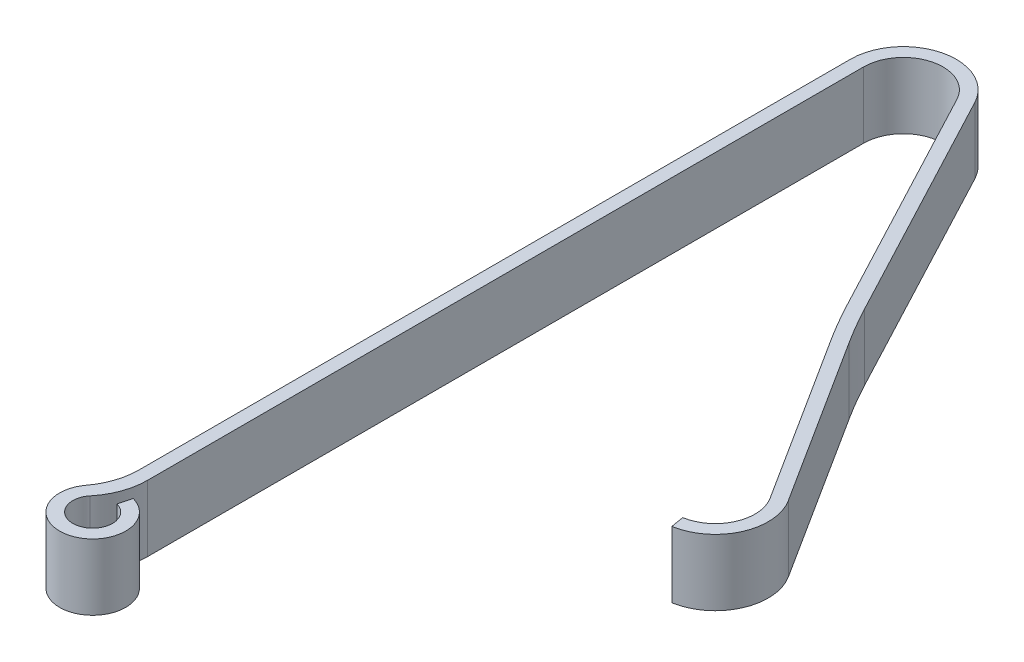
ISO-10303-21;
HEADER;
FILE_DESCRIPTION(('STEP AP214'),'2;1');
FILE_NAME('part.step','',(''),(''),'','','');
FILE_SCHEMA(('AUTOMOTIVE_DESIGN { 1 0 10303 214 1 1 1 1 }'));
ENDSEC;
DATA;
#1=APPLICATION_CONTEXT('core data for automotive mechanical design processes');
#2=APPLICATION_PROTOCOL_DEFINITION('international standard','automotive_design',2000,#1);
#3=PRODUCT_CONTEXT('',#1,'mechanical');
#4=PRODUCT('Part','Part','',(#3));
#5=PRODUCT_RELATED_PRODUCT_CATEGORY('part','',(#4));
#6=PRODUCT_DEFINITION_FORMATION('','',#4);
#7=PRODUCT_DEFINITION_CONTEXT('part definition',#1,'design');
#8=PRODUCT_DEFINITION('design','',#6,#7);
#9=PRODUCT_DEFINITION_SHAPE('','',#8);
#10=(LENGTH_UNIT() NAMED_UNIT(*) SI_UNIT(.MILLI.,.METRE.));
#11=(NAMED_UNIT(*) PLANE_ANGLE_UNIT() SI_UNIT($,.RADIAN.));
#12=(NAMED_UNIT(*) SI_UNIT($,.STERADIAN.) SOLID_ANGLE_UNIT());
#13=UNCERTAINTY_MEASURE_WITH_UNIT(LENGTH_MEASURE(1.E-05),#10,'distance_accuracy_value','');
#14=(GEOMETRIC_REPRESENTATION_CONTEXT(3) GLOBAL_UNCERTAINTY_ASSIGNED_CONTEXT((#13)) GLOBAL_UNIT_ASSIGNED_CONTEXT((#10,
#11,#12)) REPRESENTATION_CONTEXT('',''));
#15=CARTESIAN_POINT('',(0.,0.,0.));
#16=DIRECTION('',(0.,0.,1.));
#17=DIRECTION('',(1.,0.,0.));
#18=AXIS2_PLACEMENT_3D('',#15,#16,#17);
#19=CARTESIAN_POINT('',(1.016,1.27,-14.224));
#20=DIRECTION('',(0.,-1.,0.));
#21=DIRECTION('',(0.,0.,-1.));
#22=AXIS2_PLACEMENT_3D('',#19,#20,#21);
#23=CYLINDRICAL_SURFACE('',#22,1.016);
#24=CARTESIAN_POINT('',(1.016,0.,-14.224));
#25=DIRECTION('',(0.,1.,0.));
#26=DIRECTION('',(0.,0.,-1.));
#27=AXIS2_PLACEMENT_3D('',#24,#25,#26);
#28=CIRCLE('',#27,1.016);
#29=CARTESIAN_POINT('',(1.91419470541014,0.,-14.6988707941885));
#30=VERTEX_POINT('',#29);
#31=CARTESIAN_POINT('',(0.,0.,-14.224));
#32=VERTEX_POINT('',#31);
#33=EDGE_CURVE('E184',#30,#32,#28,.T.);
#34=ORIENTED_EDGE('',*,*,#33,.T.);
#35=DIRECTION('',(0.,-1.,0.));
#36=VECTOR('',#35,1.);
#37=CARTESIAN_POINT('',(0.,1.27,-14.224));
#38=LINE('',#37,#36);
#39=CARTESIAN_POINT('',(0.,1.27,-14.224));
#40=VERTEX_POINT('',#39);
#41=EDGE_CURVE('E166',#40,#32,#38,.T.);
#42=ORIENTED_EDGE('',*,*,#41,.F.);
#43=CARTESIAN_POINT('',(1.016,1.27,-14.224));
#44=DIRECTION('',(0.,1.,0.));
#45=DIRECTION('',(0.,0.,-1.));
#46=AXIS2_PLACEMENT_3D('',#43,#44,#45);
#47=CIRCLE('',#46,1.016);
#48=CARTESIAN_POINT('',(1.91419470541014,1.27,-14.6988707941885));
#49=VERTEX_POINT('',#48);
#50=EDGE_CURVE('E170',#49,#40,#47,.T.);
#51=ORIENTED_EDGE('',*,*,#50,.F.);
#52=DIRECTION('',(0.,-1.,0.));
#53=VECTOR('',#52,1.);
#54=CARTESIAN_POINT('',(1.91419470541014,1.27,-14.6988707941885));
#55=LINE('',#54,#53);
#56=EDGE_CURVE('E269',#49,#30,#55,.T.);
#57=ORIENTED_EDGE('',*,*,#56,.T.);
#58=EDGE_LOOP('',(#34,#42,#51,#57));
#59=FACE_BOUND('',#58,.T.);
#60=ADVANCED_FACE('F39',(#59),#23,.T.);
#61=CARTESIAN_POINT('',(0.,1.27,0.));
#62=DIRECTION('',(1.,0.,0.));
#63=DIRECTION('',(0.,0.,-1.));
#64=AXIS2_PLACEMENT_3D('',#61,#62,#63);
#65=PLANE('',#64);
#66=DIRECTION('',(0.,0.,1.));
#67=VECTOR('',#66,1.);
#68=CARTESIAN_POINT('',(0.,0.,0.));
#69=LINE('',#68,#67);
#70=CARTESIAN_POINT('',(0.,0.,-0.561012886740608));
#71=VERTEX_POINT('',#70);
#72=EDGE_CURVE('E217',#32,#71,#69,.T.);
#73=ORIENTED_EDGE('',*,*,#72,.T.);
#74=DIRECTION('',(0.,1.,0.));
#75=VECTOR('',#74,1.);
#76=CARTESIAN_POINT('',(0.,1.27,-0.561012886740608));
#77=LINE('',#76,#75);
#78=CARTESIAN_POINT('',(0.,1.27,-0.561012886740608));
#79=VERTEX_POINT('',#78);
#80=EDGE_CURVE('E61',#71,#79,#77,.T.);
#81=ORIENTED_EDGE('',*,*,#80,.T.);
#82=DIRECTION('',(0.,0.,1.));
#83=VECTOR('',#82,1.);
#84=CARTESIAN_POINT('',(0.,1.27,0.));
#85=LINE('',#84,#83);
#86=EDGE_CURVE('E162',#40,#79,#85,.T.);
#87=ORIENTED_EDGE('',*,*,#86,.F.);
#88=ORIENTED_EDGE('',*,*,#41,.T.);
#89=EDGE_LOOP('',(#73,#81,#87,#88));
#90=FACE_BOUND('',#89,.T.);
#91=ADVANCED_FACE('F164',(#90),#65,.F.);
#92=CARTESIAN_POINT('',(0.254,1.27,0.581987113259392));
#93=DIRECTION('',(0.,-1.,0.));
#94=DIRECTION('',(0.,0.,-1.));
#95=AXIS2_PLACEMENT_3D('',#92,#93,#94);
#96=CYLINDRICAL_SURFACE('',#95,0.635);
#97=CARTESIAN_POINT('',(0.254,1.27,0.581987113259392));
#98=DIRECTION('',(0.,1.,0.));
#99=DIRECTION('',(0.,0.,1.));
#100=AXIS2_PLACEMENT_3D('',#97,#98,#99);
#101=CIRCLE('',#100,0.635);
#102=CARTESIAN_POINT('',(-0.254,1.27,0.200987113259392));
#103=VERTEX_POINT('',#102);
#104=CARTESIAN_POINT('',(0.418350093640097,1.27,-0.0313757864341675));
#105=VERTEX_POINT('',#104);
#106=EDGE_CURVE('E169',#103,#105,#101,.T.);
#107=ORIENTED_EDGE('',*,*,#106,.F.);
#108=DIRECTION('',(0.,-1.,0.));
#109=VECTOR('',#108,1.);
#110=CARTESIAN_POINT('',(-0.254,1.27,0.200987113259392));
#111=LINE('',#110,#109);
#112=CARTESIAN_POINT('',(-0.254,0.,0.200987113259392));
#113=VERTEX_POINT('',#112);
#114=EDGE_CURVE('E207',#103,#113,#111,.T.);
#115=ORIENTED_EDGE('',*,*,#114,.T.);
#116=CARTESIAN_POINT('',(0.254,0.,0.581987113259392));
#117=DIRECTION('',(0.,1.,0.));
#118=DIRECTION('',(0.,0.,1.));
#119=AXIS2_PLACEMENT_3D('',#116,#117,#118);
#120=CIRCLE('',#119,0.635);
#121=CARTESIAN_POINT('',(0.418350093640097,0.,-0.0313757864341675));
#122=VERTEX_POINT('',#121);
#123=EDGE_CURVE('E219',#113,#122,#120,.T.);
#124=ORIENTED_EDGE('',*,*,#123,.T.);
#125=DIRECTION('',(0.,-1.,0.));
#126=VECTOR('',#125,1.);
#127=CARTESIAN_POINT('',(0.418350093640097,1.27,-0.0313757864341675));
#128=LINE('',#127,#126);
#129=EDGE_CURVE('E187',#105,#122,#128,.T.);
#130=ORIENTED_EDGE('',*,*,#129,.F.);
#131=EDGE_LOOP('',(#107,#115,#124,#130));
#132=FACE_BOUND('',#131,.T.);
#133=ADVANCED_FACE('F225',(#132),#96,.T.);
#134=CARTESIAN_POINT('',(0.418350093640097,1.27,-0.0313757864341675));
#135=DIRECTION('',(0.96592582628907,0.,0.258819045102514));
#136=DIRECTION('',(0.258819045102514,0.,-0.96592582628907));
#137=AXIS2_PLACEMENT_3D('',#134,#135,#136);
#138=PLANE('',#137);
#139=DIRECTION('',(-0.258819045102514,0.,0.96592582628907));
#140=VECTOR('',#139,1.);
#141=CARTESIAN_POINT('',(0.418350093640097,0.,-0.0313757864341675));
#142=LINE('',#141,#140);
#143=CARTESIAN_POINT('',(0.352610056184058,0.,0.213969373443256));
#144=VERTEX_POINT('',#143);
#145=EDGE_CURVE('E274',#122,#144,#142,.T.);
#146=ORIENTED_EDGE('',*,*,#145,.T.);
#147=DIRECTION('',(0.,-1.,0.));
#148=VECTOR('',#147,1.);
#149=CARTESIAN_POINT('',(0.352610056184058,1.27,0.213969373443256));
#150=LINE('',#149,#148);
#151=CARTESIAN_POINT('',(0.352610056184058,1.27,0.213969373443256));
#152=VERTEX_POINT('',#151);
#153=EDGE_CURVE('E195',#152,#144,#150,.T.);
#154=ORIENTED_EDGE('',*,*,#153,.F.);
#155=DIRECTION('',(-0.258819045102514,0.,0.96592582628907));
#156=VECTOR('',#155,1.);
#157=CARTESIAN_POINT('',(0.418350093640097,1.27,-0.0313757864341675));
#158=LINE('',#157,#156);
#159=EDGE_CURVE('E229',#105,#152,#158,.T.);
#160=ORIENTED_EDGE('',*,*,#159,.F.);
#161=ORIENTED_EDGE('',*,*,#129,.T.);
#162=EDGE_LOOP('',(#146,#154,#160,#161));
#163=FACE_BOUND('',#162,.T.);
#164=ADVANCED_FACE('F374',(#163),#138,.F.);
#165=CARTESIAN_POINT('',(0.254,1.27,0.581987113259392));
#166=DIRECTION('',(0.,-1.,0.));
#167=DIRECTION('',(0.,0.,-1.));
#168=AXIS2_PLACEMENT_3D('',#165,#166,#167);
#169=CYLINDRICAL_SURFACE('',#168,0.381);
#170=CARTESIAN_POINT('',(0.254,0.,0.581987113259392));
#171=DIRECTION('',(0.,-1.,0.));
#172=DIRECTION('',(0.,0.,1.));
#173=AXIS2_PLACEMENT_3D('',#170,#171,#172);
#174=CIRCLE('',#173,0.381);
#175=CARTESIAN_POINT('',(-0.0390769230769229,0.,0.338539136969255));
#176=VERTEX_POINT('',#175);
#177=EDGE_CURVE('E277',#144,#176,#174,.T.);
#178=ORIENTED_EDGE('',*,*,#177,.T.);
#179=DIRECTION('',(0.,-1.,0.));
#180=VECTOR('',#179,1.);
#181=CARTESIAN_POINT('',(-0.039076923076923,1.27,0.338539136969255));
#182=LINE('',#181,#180);
#183=CARTESIAN_POINT('',(-0.0390769230769229,1.27,0.338539136969255));
#184=VERTEX_POINT('',#183);
#185=EDGE_CURVE('E201',#176,#184,#182,.F.);
#186=ORIENTED_EDGE('',*,*,#185,.T.);
#187=CARTESIAN_POINT('',(0.254,1.27,0.581987113259392));
#188=DIRECTION('',(0.,-1.,0.));
#189=DIRECTION('',(0.,0.,1.));
#190=AXIS2_PLACEMENT_3D('',#187,#188,#189);
#191=CIRCLE('',#190,0.381);
#192=EDGE_CURVE('E232',#152,#184,#191,.T.);
#193=ORIENTED_EDGE('',*,*,#192,.F.);
#194=ORIENTED_EDGE('',*,*,#153,.T.);
#195=EDGE_LOOP('',(#178,#186,#193,#194));
#196=FACE_BOUND('',#195,.T.);
#197=ADVANCED_FACE('F360',(#196),#169,.F.);
#198=CARTESIAN_POINT('',(0.254,1.27,0.200987113259392));
#199=DIRECTION('',(-1.,0.,0.));
#200=DIRECTION('',(0.,0.,1.));
#201=AXIS2_PLACEMENT_3D('',#198,#199,#200);
#202=PLANE('',#201);
#203=DIRECTION('',(0.,0.,-1.));
#204=VECTOR('',#203,1.);
#205=CARTESIAN_POINT('',(0.254,1.27,0.200987113259392));
#206=LINE('',#205,#204);
#207=CARTESIAN_POINT('',(0.254,1.27,-0.472954117331203));
#208=VERTEX_POINT('',#207);
#209=CARTESIAN_POINT('',(0.254,1.27,-14.224));
#210=VERTEX_POINT('',#209);
#211=EDGE_CURVE('E237',#208,#210,#206,.T.);
#212=ORIENTED_EDGE('',*,*,#211,.F.);
#213=DIRECTION('',(0.,-1.,0.));
#214=VECTOR('',#213,1.);
#215=CARTESIAN_POINT('',(0.254,1.27,-0.472954117331203));
#216=LINE('',#215,#214);
#217=CARTESIAN_POINT('',(0.254,0.,-0.472954117331203));
#218=VERTEX_POINT('',#217);
#219=EDGE_CURVE('E186',#208,#218,#216,.T.);
#220=ORIENTED_EDGE('',*,*,#219,.T.);
#221=DIRECTION('',(0.,0.,-1.));
#222=VECTOR('',#221,1.);
#223=CARTESIAN_POINT('',(0.254,0.,0.200987113259392));
#224=LINE('',#223,#222);
#225=CARTESIAN_POINT('',(0.254,0.,-14.224));
#226=VERTEX_POINT('',#225);
#227=EDGE_CURVE('E281',#218,#226,#224,.T.);
#228=ORIENTED_EDGE('',*,*,#227,.T.);
#229=DIRECTION('',(0.,-1.,0.));
#230=VECTOR('',#229,1.);
#231=CARTESIAN_POINT('',(0.254,1.27,-14.224));
#232=LINE('',#231,#230);
#233=EDGE_CURVE('E351',#210,#226,#232,.T.);
#234=ORIENTED_EDGE('',*,*,#233,.F.);
#235=EDGE_LOOP('',(#212,#220,#228,#234));
#236=FACE_BOUND('',#235,.T.);
#237=ADVANCED_FACE('F370',(#236),#202,.F.);
#238=CARTESIAN_POINT('',(1.016,1.27,-14.224));
#239=DIRECTION('',(0.,-1.,0.));
#240=DIRECTION('',(0.,0.,-1.));
#241=AXIS2_PLACEMENT_3D('',#238,#239,#240);
#242=CYLINDRICAL_SURFACE('',#241,0.762);
#243=CARTESIAN_POINT('',(1.016,0.,-14.224));
#244=DIRECTION('',(0.,-1.,0.));
#245=DIRECTION('',(0.,0.,-1.));
#246=AXIS2_PLACEMENT_3D('',#243,#244,#245);
#247=CIRCLE('',#246,0.762);
#248=CARTESIAN_POINT('',(1.6896460290576,0.,-14.5801530956414));
#249=VERTEX_POINT('',#248);
#250=EDGE_CURVE('E284',#226,#249,#247,.T.);
#251=ORIENTED_EDGE('',*,*,#250,.T.);
#252=DIRECTION('',(0.,-1.,0.));
#253=VECTOR('',#252,1.);
#254=CARTESIAN_POINT('',(1.6896460290576,1.27,-14.5801530956414));
#255=LINE('',#254,#253);
#256=CARTESIAN_POINT('',(1.6896460290576,1.27,-14.5801530956414));
#257=VERTEX_POINT('',#256);
#258=EDGE_CURVE('E347',#257,#249,#255,.T.);
#259=ORIENTED_EDGE('',*,*,#258,.F.);
#260=CARTESIAN_POINT('',(1.016,1.27,-14.224));
#261=DIRECTION('',(0.,-1.,0.));
#262=DIRECTION('',(0.,0.,-1.));
#263=AXIS2_PLACEMENT_3D('',#260,#261,#262);
#264=CIRCLE('',#263,0.762);
#265=EDGE_CURVE('E240',#210,#257,#264,.T.);
#266=ORIENTED_EDGE('',*,*,#265,.F.);
#267=ORIENTED_EDGE('',*,*,#233,.T.);
#268=EDGE_LOOP('',(#251,#259,#266,#267));
#269=FACE_BOUND('',#268,.T.);
#270=ADVANCED_FACE('F435',(#269),#242,.F.);
#271=CARTESIAN_POINT('',(1.6896460290576,1.27,-14.5801530956414));
#272=DIRECTION('',(0.884049906899741,0.,-0.467392513965039));
#273=DIRECTION('',(-0.467392513965039,0.,-0.884049906899741));
#274=AXIS2_PLACEMENT_3D('',#271,#272,#273);
#275=PLANE('',#274);
#276=DIRECTION('',(0.467392513965039,0.,0.884049906899741));
#277=VECTOR('',#276,1.);
#278=CARTESIAN_POINT('',(1.6896460290576,0.,-14.5801530956414));
#279=LINE('',#278,#277);
#280=CARTESIAN_POINT('',(4.064,0.,-10.0891795685907));
#281=VERTEX_POINT('',#280);
#282=EDGE_CURVE('E287',#249,#281,#279,.T.);
#283=ORIENTED_EDGE('',*,*,#282,.T.);
#284=DIRECTION('',(0.,-1.,0.));
#285=VECTOR('',#284,1.);
#286=CARTESIAN_POINT('',(4.064,1.27,-10.0891795685907));
#287=LINE('',#286,#285);
#288=CARTESIAN_POINT('',(4.064,1.27,-10.0891795685907));
#289=VERTEX_POINT('',#288);
#290=EDGE_CURVE('E343',#289,#281,#287,.T.);
#291=ORIENTED_EDGE('',*,*,#290,.F.);
#292=DIRECTION('',(0.467392513965039,0.,0.884049906899741));
#293=VECTOR('',#292,1.);
#294=CARTESIAN_POINT('',(1.6896460290576,1.27,-14.5801530956414));
#295=LINE('',#294,#293);
#296=EDGE_CURVE('E243',#257,#289,#295,.T.);
#297=ORIENTED_EDGE('',*,*,#296,.F.);
#298=ORIENTED_EDGE('',*,*,#258,.T.);
#299=EDGE_LOOP('',(#283,#291,#297,#298));
#300=FACE_BOUND('',#299,.T.);
#301=ADVANCED_FACE('F431',(#300),#275,.F.);
#302=CARTESIAN_POINT('',(13.2704957304539,1.27,-14.9566052090226));
#303=DIRECTION('',(0.,-1.,0.));
#304=DIRECTION('',(0.,0.,-1.));
#305=AXIS2_PLACEMENT_3D('',#302,#303,#304);
#306=CYLINDRICAL_SURFACE('',#305,10.414);
#307=CARTESIAN_POINT('',(13.2704957304539,0.,-14.9566052090226));
#308=DIRECTION('',(0.,1.,0.));
#309=DIRECTION('',(0.,0.,1.));
#310=AXIS2_PLACEMENT_3D('',#307,#308,#309);
#311=CIRCLE('',#310,10.414);
#312=CARTESIAN_POINT('',(4.48470169132067,0.,-9.36543188833838));
#313=VERTEX_POINT('',#312);
#314=EDGE_CURVE('E290',#281,#313,#311,.T.);
#315=ORIENTED_EDGE('',*,*,#314,.T.);
#316=DIRECTION('',(0.,-1.,0.));
#317=VECTOR('',#316,1.);
#318=CARTESIAN_POINT('',(4.48470169132067,1.27,-9.36543188833838));
#319=LINE('',#318,#317);
#320=CARTESIAN_POINT('',(4.48470169132067,1.27,-9.36543188833838));
#321=VERTEX_POINT('',#320);
#322=EDGE_CURVE('E339',#321,#313,#319,.T.);
#323=ORIENTED_EDGE('',*,*,#322,.F.);
#324=CARTESIAN_POINT('',(13.2704957304539,1.27,-14.9566052090226));
#325=DIRECTION('',(0.,1.,0.));
#326=DIRECTION('',(0.,0.,1.));
#327=AXIS2_PLACEMENT_3D('',#324,#325,#326);
#328=CIRCLE('',#327,10.414);
#329=EDGE_CURVE('E246',#289,#321,#328,.T.);
#330=ORIENTED_EDGE('',*,*,#329,.F.);
#331=ORIENTED_EDGE('',*,*,#290,.T.);
#332=EDGE_LOOP('',(#315,#323,#330,#331));
#333=FACE_BOUND('',#332,.T.);
#334=ADVANCED_FACE('F427',(#333),#306,.T.);
#335=CARTESIAN_POINT('',(4.48470169132067,1.27,-9.36543188833838));
#336=DIRECTION('',(0.843652202720687,0.,-0.536890082646842));
#337=DIRECTION('',(-0.536890082646842,0.,-0.843652202720687));
#338=AXIS2_PLACEMENT_3D('',#335,#336,#337);
#339=PLANE('',#338);
#340=DIRECTION('',(0.536890082646842,0.,0.843652202720687));
#341=VECTOR('',#340,1.);
#342=CARTESIAN_POINT('',(4.48470169132067,0.,-9.36543188833838));
#343=LINE('',#342,#341);
#344=CARTESIAN_POINT('',(6.53025290620513,0.,-6.15111699597256));
#345=VERTEX_POINT('',#344);
#346=EDGE_CURVE('E293',#313,#345,#343,.T.);
#347=ORIENTED_EDGE('',*,*,#346,.T.);
#348=DIRECTION('',(0.,-1.,0.));
#349=VECTOR('',#348,1.);
#350=CARTESIAN_POINT('',(6.53025290620513,1.27,-6.15111699597256));
#351=LINE('',#350,#349);
#352=CARTESIAN_POINT('',(6.53025290620513,1.27,-6.15111699597256));
#353=VERTEX_POINT('',#352);
#354=EDGE_CURVE('E335',#353,#345,#351,.T.);
#355=ORIENTED_EDGE('',*,*,#354,.F.);
#356=DIRECTION('',(0.536890082646842,0.,0.843652202720687));
#357=VECTOR('',#356,1.);
#358=CARTESIAN_POINT('',(4.48470169132067,1.27,-9.36543188833838));
#359=LINE('',#358,#357);
#360=EDGE_CURVE('E249',#321,#353,#359,.T.);
#361=ORIENTED_EDGE('',*,*,#360,.F.);
#362=ORIENTED_EDGE('',*,*,#322,.T.);
#363=EDGE_LOOP('',(#347,#355,#361,#362));
#364=FACE_BOUND('',#363,.T.);
#365=ADVANCED_FACE('F423',(#364),#339,.F.);
#366=CARTESIAN_POINT('',(5.88738992773197,1.27,-5.74200675299567));
#367=DIRECTION('',(0.,-1.,0.));
#368=DIRECTION('',(0.,0.,-1.));
#369=AXIS2_PLACEMENT_3D('',#366,#367,#368);
#370=CYLINDRICAL_SURFACE('',#369,0.761999999999999);
#371=CARTESIAN_POINT('',(5.88738992773197,0.,-5.74200675299567));
#372=DIRECTION('',(0.,-1.,0.));
#373=DIRECTION('',(0.,0.,-1.));
#374=AXIS2_PLACEMENT_3D('',#371,#372,#373);
#375=CIRCLE('',#374,0.761999999999999);
#376=CARTESIAN_POINT('',(6.01310664573218,0.,-4.9904488331949));
#377=VERTEX_POINT('',#376);
#378=EDGE_CURVE('E296',#345,#377,#375,.T.);
#379=ORIENTED_EDGE('',*,*,#378,.T.);
#380=DIRECTION('',(0.,-1.,0.));
#381=VECTOR('',#380,1.);
#382=CARTESIAN_POINT('',(6.01310664573218,1.27,-4.9904488331949));
#383=LINE('',#382,#381);
#384=CARTESIAN_POINT('',(6.01310664573218,1.27,-4.9904488331949));
#385=VERTEX_POINT('',#384);
#386=EDGE_CURVE('E331',#385,#377,#383,.T.);
#387=ORIENTED_EDGE('',*,*,#386,.F.);
#388=CARTESIAN_POINT('',(5.88738992773197,1.27,-5.74200675299567));
#389=DIRECTION('',(0.,-1.,0.));
#390=DIRECTION('',(0.,0.,-1.));
#391=AXIS2_PLACEMENT_3D('',#388,#389,#390);
#392=CIRCLE('',#391,0.761999999999999);
#393=EDGE_CURVE('E252',#353,#385,#392,.T.);
#394=ORIENTED_EDGE('',*,*,#393,.F.);
#395=ORIENTED_EDGE('',*,*,#354,.T.);
#396=EDGE_LOOP('',(#379,#387,#394,#395));
#397=FACE_BOUND('',#396,.T.);
#398=ADVANCED_FACE('F419',(#397),#370,.F.);
#399=CARTESIAN_POINT('',(6.01310664573218,1.27,-4.9904488331949));
#400=DIRECTION('',(0.986296482678172,0.,-0.16498256955408));
#401=DIRECTION('',(-0.16498256955408,0.,-0.986296482678172));
#402=AXIS2_PLACEMENT_3D('',#399,#400,#401);
#403=PLANE('',#402);
#404=DIRECTION('',(0.16498256955408,0.,0.986296482678172));
#405=VECTOR('',#404,1.);
#406=CARTESIAN_POINT('',(6.01310664573218,0.,-4.9904488331949));
#407=LINE('',#406,#405);
#408=CARTESIAN_POINT('',(6.05501221839892,0.,-4.73992952659464));
#409=VERTEX_POINT('',#408);
#410=EDGE_CURVE('E299',#377,#409,#407,.T.);
#411=ORIENTED_EDGE('',*,*,#410,.T.);
#412=DIRECTION('',(0.,-1.,0.));
#413=VECTOR('',#412,1.);
#414=CARTESIAN_POINT('',(6.05501221839892,1.27,-4.73992952659464));
#415=LINE('',#414,#413);
#416=CARTESIAN_POINT('',(6.05501221839892,1.27,-4.73992952659464));
#417=VERTEX_POINT('',#416);
#418=EDGE_CURVE('E327',#417,#409,#415,.T.);
#419=ORIENTED_EDGE('',*,*,#418,.F.);
#420=DIRECTION('',(0.16498256955408,0.,0.986296482678172));
#421=VECTOR('',#420,1.);
#422=CARTESIAN_POINT('',(6.01310664573218,1.27,-4.9904488331949));
#423=LINE('',#422,#421);
#424=EDGE_CURVE('E255',#385,#417,#423,.T.);
#425=ORIENTED_EDGE('',*,*,#424,.F.);
#426=ORIENTED_EDGE('',*,*,#386,.T.);
#427=EDGE_LOOP('',(#411,#419,#425,#426));
#428=FACE_BOUND('',#427,.T.);
#429=ADVANCED_FACE('F415',(#428),#403,.F.);
#430=CARTESIAN_POINT('',(5.88738992773197,1.27,-5.74200675299567));
#431=DIRECTION('',(0.,-1.,0.));
#432=DIRECTION('',(0.,0.,-1.));
#433=AXIS2_PLACEMENT_3D('',#430,#431,#432);
#434=CYLINDRICAL_SURFACE('',#433,1.016);
#435=CARTESIAN_POINT('',(5.88738992773197,0.,-5.74200675299567));
#436=DIRECTION('',(0.,1.,0.));
#437=DIRECTION('',(0.,0.,-1.));
#438=AXIS2_PLACEMENT_3D('',#435,#436,#437);
#439=CIRCLE('',#438,1.016);
#440=CARTESIAN_POINT('',(6.74454056569619,0.,-6.28748707696486));
#441=VERTEX_POINT('',#440);
#442=EDGE_CURVE('E302',#409,#441,#439,.T.);
#443=ORIENTED_EDGE('',*,*,#442,.T.);
#444=DIRECTION('',(0.,-1.,0.));
#445=VECTOR('',#444,1.);
#446=CARTESIAN_POINT('',(6.74454056569619,1.27,-6.28748707696486));
#447=LINE('',#446,#445);
#448=CARTESIAN_POINT('',(6.74454056569619,1.27,-6.28748707696486));
#449=VERTEX_POINT('',#448);
#450=EDGE_CURVE('E323',#449,#441,#447,.T.);
#451=ORIENTED_EDGE('',*,*,#450,.F.);
#452=CARTESIAN_POINT('',(5.88738992773197,1.27,-5.74200675299567));
#453=DIRECTION('',(0.,1.,0.));
#454=DIRECTION('',(0.,0.,-1.));
#455=AXIS2_PLACEMENT_3D('',#452,#453,#454);
#456=CIRCLE('',#455,1.016);
#457=EDGE_CURVE('E258',#417,#449,#456,.T.);
#458=ORIENTED_EDGE('',*,*,#457,.F.);
#459=ORIENTED_EDGE('',*,*,#418,.T.);
#460=EDGE_LOOP('',(#443,#451,#458,#459));
#461=FACE_BOUND('',#460,.T.);
#462=ADVANCED_FACE('F411',(#461),#434,.T.);
#463=CARTESIAN_POINT('',(4.69898935081172,1.27,-9.50180196933067));
#464=DIRECTION('',(-0.843652202720687,0.,0.536890082646841));
#465=DIRECTION('',(0.536890082646841,0.,0.843652202720688));
#466=AXIS2_PLACEMENT_3D('',#463,#464,#465);
#467=PLANE('',#466);
#468=DIRECTION('',(-0.536890082646841,0.,-0.843652202720688));
#469=VECTOR('',#468,1.);
#470=CARTESIAN_POINT('',(4.69898935081172,0.,-9.50180196933067));
#471=LINE('',#470,#469);
#472=CARTESIAN_POINT('',(4.69898935081172,0.,-9.50180196933067));
#473=VERTEX_POINT('',#472);
#474=EDGE_CURVE('E305',#441,#473,#471,.T.);
#475=ORIENTED_EDGE('',*,*,#474,.T.);
#476=DIRECTION('',(0.,-1.,0.));
#477=VECTOR('',#476,1.);
#478=CARTESIAN_POINT('',(4.69898935081172,1.27,-9.50180196933067));
#479=LINE('',#478,#477);
#480=CARTESIAN_POINT('',(4.69898935081172,1.27,-9.50180196933067));
#481=VERTEX_POINT('',#480);
#482=EDGE_CURVE('E319',#481,#473,#479,.T.);
#483=ORIENTED_EDGE('',*,*,#482,.F.);
#484=DIRECTION('',(-0.536890082646841,0.,-0.843652202720688));
#485=VECTOR('',#484,1.);
#486=CARTESIAN_POINT('',(4.69898935081172,1.27,-9.50180196933067));
#487=LINE('',#486,#485);
#488=EDGE_CURVE('E261',#449,#481,#487,.T.);
#489=ORIENTED_EDGE('',*,*,#488,.F.);
#490=ORIENTED_EDGE('',*,*,#450,.T.);
#491=EDGE_LOOP('',(#475,#483,#489,#490));
#492=FACE_BOUND('',#491,.T.);
#493=ADVANCED_FACE('F407',(#492),#467,.F.);
#494=CARTESIAN_POINT('',(13.2704957304539,1.27,-14.9566052090226));
#495=DIRECTION('',(0.,-1.,0.));
#496=DIRECTION('',(0.,0.,-1.));
#497=AXIS2_PLACEMENT_3D('',#494,#495,#496);
#498=CYLINDRICAL_SURFACE('',#497,10.16);
#499=CARTESIAN_POINT('',(13.2704957304539,0.,-14.9566052090226));
#500=DIRECTION('',(0.,-1.,0.));
#501=DIRECTION('',(0.,0.,1.));
#502=AXIS2_PLACEMENT_3D('',#499,#500,#501);
#503=CIRCLE('',#502,10.16);
#504=CARTESIAN_POINT('',(4.28854867635253,0.,-10.2078972671378));
#505=VERTEX_POINT('',#504);
#506=EDGE_CURVE('E308',#473,#505,#503,.T.);
#507=ORIENTED_EDGE('',*,*,#506,.T.);
#508=DIRECTION('',(0.,-1.,0.));
#509=VECTOR('',#508,1.);
#510=CARTESIAN_POINT('',(4.28854867635253,1.27,-10.2078972671378));
#511=LINE('',#510,#509);
#512=CARTESIAN_POINT('',(4.28854867635253,1.27,-10.2078972671378));
#513=VERTEX_POINT('',#512);
#514=EDGE_CURVE('E315',#513,#505,#511,.T.);
#515=ORIENTED_EDGE('',*,*,#514,.F.);
#516=CARTESIAN_POINT('',(13.2704957304539,1.27,-14.9566052090226));
#517=DIRECTION('',(0.,-1.,0.));
#518=DIRECTION('',(0.,0.,1.));
#519=AXIS2_PLACEMENT_3D('',#516,#517,#518);
#520=CIRCLE('',#519,10.16);
#521=EDGE_CURVE('E264',#481,#513,#520,.T.);
#522=ORIENTED_EDGE('',*,*,#521,.F.);
#523=ORIENTED_EDGE('',*,*,#482,.T.);
#524=EDGE_LOOP('',(#507,#515,#522,#523));
#525=FACE_BOUND('',#524,.T.);
#526=ADVANCED_FACE('F403',(#525),#498,.F.);
#527=CARTESIAN_POINT('',(1.91419470541014,1.27,-14.6988707941885));
#528=DIRECTION('',(-0.884049906899741,0.,0.467392513965039));
#529=DIRECTION('',(0.467392513965039,0.,0.884049906899741));
#530=AXIS2_PLACEMENT_3D('',#527,#528,#529);
#531=PLANE('',#530);
#532=DIRECTION('',(-0.467392513965039,0.,-0.884049906899741));
#533=VECTOR('',#532,1.);
#534=CARTESIAN_POINT('',(1.91419470541014,0.,-14.6988707941885));
#535=LINE('',#534,#533);
#536=EDGE_CURVE('E181',#505,#30,#535,.T.);
#537=ORIENTED_EDGE('',*,*,#536,.T.);
#538=ORIENTED_EDGE('',*,*,#56,.F.);
#539=DIRECTION('',(-0.467392513965039,0.,-0.884049906899741));
#540=VECTOR('',#539,1.);
#541=CARTESIAN_POINT('',(1.91419470541014,1.27,-14.6988707941885));
#542=LINE('',#541,#540);
#543=EDGE_CURVE('E176',#513,#49,#542,.T.);
#544=ORIENTED_EDGE('',*,*,#543,.F.);
#545=ORIENTED_EDGE('',*,*,#514,.T.);
#546=EDGE_LOOP('',(#537,#538,#544,#545));
#547=FACE_BOUND('',#546,.T.);
#548=ADVANCED_FACE('F398',(#547),#531,.F.);
#549=CARTESIAN_POINT('',(1.016,1.27,-14.224));
#550=DIRECTION('',(0.,-1.,0.));
#551=DIRECTION('',(0.,0.,-1.));
#552=AXIS2_PLACEMENT_3D('',#549,#550,#551);
#553=PLANE('',#552);
#554=ORIENTED_EDGE('',*,*,#192,.T.);
#555=CARTESIAN_POINT('',(-1.016,1.27,-0.472954117331203));
#556=DIRECTION('',(0.,-1.,0.));
#557=DIRECTION('',(0.,0.,-1.));
#558=AXIS2_PLACEMENT_3D('',#555,#556,#557);
#559=CIRCLE('',#558,1.27);
#560=EDGE_CURVE('E204',#184,#208,#559,.F.);
#561=ORIENTED_EDGE('',*,*,#560,.T.);
#562=ORIENTED_EDGE('',*,*,#211,.T.);
#563=ORIENTED_EDGE('',*,*,#265,.T.);
#564=ORIENTED_EDGE('',*,*,#296,.T.);
#565=ORIENTED_EDGE('',*,*,#329,.T.);
#566=ORIENTED_EDGE('',*,*,#360,.T.);
#567=ORIENTED_EDGE('',*,*,#393,.T.);
#568=ORIENTED_EDGE('',*,*,#424,.T.);
#569=ORIENTED_EDGE('',*,*,#457,.T.);
#570=ORIENTED_EDGE('',*,*,#488,.T.);
#571=ORIENTED_EDGE('',*,*,#521,.T.);
#572=ORIENTED_EDGE('',*,*,#543,.T.);
#573=ORIENTED_EDGE('',*,*,#50,.T.);
#574=ORIENTED_EDGE('',*,*,#86,.T.);
#575=CARTESIAN_POINT('',(-1.27,1.27,-0.561012886740608));
#576=DIRECTION('',(0.,-1.,0.));
#577=DIRECTION('',(0.,0.,-1.));
#578=AXIS2_PLACEMENT_3D('',#575,#576,#577);
#579=CIRCLE('',#578,1.27);
#580=EDGE_CURVE('E11',#79,#103,#579,.T.);
#581=ORIENTED_EDGE('',*,*,#580,.T.);
#582=ORIENTED_EDGE('',*,*,#106,.T.);
#583=ORIENTED_EDGE('',*,*,#159,.T.);
#584=EDGE_LOOP('',(#554,#561,#562,#563,#564,#565,#566,#567,#568,#569,#570,#571,#572,#573,#574,
#581,#582,#583));
#585=FACE_BOUND('',#584,.T.);
#586=ADVANCED_FACE('F174',(#585),#553,.F.);
#587=CARTESIAN_POINT('',(1.016,0.,-14.224));
#588=DIRECTION('',(0.,-1.,0.));
#589=DIRECTION('',(0.,0.,-1.));
#590=AXIS2_PLACEMENT_3D('',#587,#588,#589);
#591=PLANE('',#590);
#592=ORIENTED_EDGE('',*,*,#227,.F.);
#593=CARTESIAN_POINT('',(-1.016,0.,-0.472954117331203));
#594=DIRECTION('',(0.,-1.,0.));
#595=DIRECTION('',(0.,0.,-1.));
#596=AXIS2_PLACEMENT_3D('',#593,#594,#595);
#597=CIRCLE('',#596,1.27);
#598=EDGE_CURVE('E192',#218,#176,#597,.T.);
#599=ORIENTED_EDGE('',*,*,#598,.T.);
#600=ORIENTED_EDGE('',*,*,#177,.F.);
#601=ORIENTED_EDGE('',*,*,#145,.F.);
#602=ORIENTED_EDGE('',*,*,#123,.F.);
#603=CARTESIAN_POINT('',(-1.27,0.,-0.561012886740608));
#604=DIRECTION('',(0.,-1.,0.));
#605=DIRECTION('',(0.,0.,-1.));
#606=AXIS2_PLACEMENT_3D('',#603,#604,#605);
#607=CIRCLE('',#606,1.27);
#608=EDGE_CURVE('E48',#113,#71,#607,.F.);
#609=ORIENTED_EDGE('',*,*,#608,.T.);
#610=ORIENTED_EDGE('',*,*,#72,.F.);
#611=ORIENTED_EDGE('',*,*,#33,.F.);
#612=ORIENTED_EDGE('',*,*,#536,.F.);
#613=ORIENTED_EDGE('',*,*,#506,.F.);
#614=ORIENTED_EDGE('',*,*,#474,.F.);
#615=ORIENTED_EDGE('',*,*,#442,.F.);
#616=ORIENTED_EDGE('',*,*,#410,.F.);
#617=ORIENTED_EDGE('',*,*,#378,.F.);
#618=ORIENTED_EDGE('',*,*,#346,.F.);
#619=ORIENTED_EDGE('',*,*,#314,.F.);
#620=ORIENTED_EDGE('',*,*,#282,.F.);
#621=ORIENTED_EDGE('',*,*,#250,.F.);
#622=EDGE_LOOP('',(#592,#599,#600,#601,#602,#609,#610,#611,#612,#613,#614,#615,#616,#617,#618,
#619,#620,#621));
#623=FACE_BOUND('',#622,.T.);
#624=ADVANCED_FACE('F216',(#623),#591,.T.);
#625=CARTESIAN_POINT('',(-1.016,1.27,-0.472954117331203));
#626=DIRECTION('',(0.,-1.,0.));
#627=DIRECTION('',(0.,0.,-1.));
#628=AXIS2_PLACEMENT_3D('',#625,#626,#627);
#629=CYLINDRICAL_SURFACE('',#628,1.27);
#630=ORIENTED_EDGE('',*,*,#560,.F.);
#631=ORIENTED_EDGE('',*,*,#185,.F.);
#632=ORIENTED_EDGE('',*,*,#598,.F.);
#633=ORIENTED_EDGE('',*,*,#219,.F.);
#634=EDGE_LOOP('',(#630,#631,#632,#633));
#635=FACE_BOUND('',#634,.T.);
#636=ADVANCED_FACE('F367',(#635),#629,.T.);
#637=CARTESIAN_POINT('',(-1.27,1.27,-0.561012886740608));
#638=DIRECTION('',(0.,-1.,0.));
#639=DIRECTION('',(0.,0.,-1.));
#640=AXIS2_PLACEMENT_3D('',#637,#638,#639);
#641=CYLINDRICAL_SURFACE('',#640,1.27);
#642=ORIENTED_EDGE('',*,*,#580,.F.);
#643=ORIENTED_EDGE('',*,*,#80,.F.);
#644=ORIENTED_EDGE('',*,*,#608,.F.);
#645=ORIENTED_EDGE('',*,*,#114,.F.);
#646=EDGE_LOOP('',(#642,#643,#644,#645));
#647=FACE_BOUND('',#646,.T.);
#648=ADVANCED_FACE('F41',(#647),#641,.F.);
#649=CLOSED_SHELL('',(#60,#91,#133,#164,#197,#237,#270,#301,#334,#365,#398,#429,#462,#493,#526,
#548,#586,#624,#636,#648));
#650=MANIFOLD_SOLID_BREP('B2',#649);
#651=ADVANCED_BREP_SHAPE_REPRESENTATION('',(#18,#650),#14);
#652=SHAPE_DEFINITION_REPRESENTATION(#9,#651);
ENDSEC;
END-ISO-10303-21;
